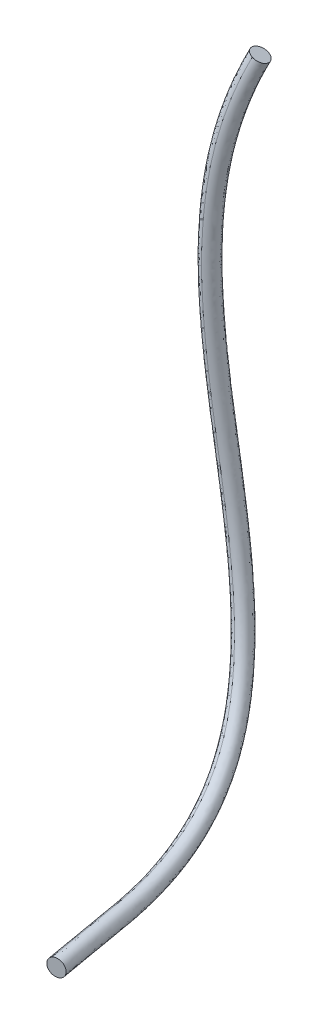
ISO-10303-21;
HEADER;
FILE_DESCRIPTION(('STEP AP214'),'2;1');
FILE_NAME('part.step','',(''),(''),'','','');
FILE_SCHEMA(('AUTOMOTIVE_DESIGN { 1 0 10303 214 1 1 1 1 }'));
ENDSEC;
DATA;
#1=APPLICATION_CONTEXT('core data for automotive mechanical design processes');
#2=APPLICATION_PROTOCOL_DEFINITION('international standard','automotive_design',2000,#1);
#3=PRODUCT_CONTEXT('',#1,'mechanical');
#4=PRODUCT('Part','Part','',(#3));
#5=PRODUCT_RELATED_PRODUCT_CATEGORY('part','',(#4));
#6=PRODUCT_DEFINITION_FORMATION('','',#4);
#7=PRODUCT_DEFINITION_CONTEXT('part definition',#1,'design');
#8=PRODUCT_DEFINITION('design','',#6,#7);
#9=PRODUCT_DEFINITION_SHAPE('','',#8);
#10=(LENGTH_UNIT() NAMED_UNIT(*) SI_UNIT(.MILLI.,.METRE.));
#11=(NAMED_UNIT(*) PLANE_ANGLE_UNIT() SI_UNIT($,.RADIAN.));
#12=(NAMED_UNIT(*) SI_UNIT($,.STERADIAN.) SOLID_ANGLE_UNIT());
#13=UNCERTAINTY_MEASURE_WITH_UNIT(LENGTH_MEASURE(1.E-05),#10,'distance_accuracy_value','');
#14=(GEOMETRIC_REPRESENTATION_CONTEXT(3) GLOBAL_UNCERTAINTY_ASSIGNED_CONTEXT((#13)) GLOBAL_UNIT_ASSIGNED_CONTEXT((#10,
#11,#12)) REPRESENTATION_CONTEXT('',''));
#15=CARTESIAN_POINT('',(0.,0.,0.));
#16=DIRECTION('',(0.,0.,1.));
#17=DIRECTION('',(1.,0.,0.));
#18=AXIS2_PLACEMENT_3D('',#15,#16,#17);
#19=CARTESIAN_POINT('',(-141.024062990475,58.5874318404684,-151.426198648371));
#20=CARTESIAN_POINT('',(-144.752577365455,60.0020186521244,-151.73784703149));
#21=CARTESIAN_POINT('',(-142.932795525807,58.3227268223134,-155.461873482319));
#22=CARTESIAN_POINT('',(-139.20428115163,56.9081400109578,-155.150225099257));
#23=CARTESIAN_POINT('',(-137.295548617087,57.1728450294168,-151.114550265385));
#24=CARTESIAN_POINT('',(-141.024062990475,58.5874318404684,-151.426198648371));
#25=CARTESIAN_POINT('',(-142.358130277843,55.2194093055224,-150.567133185133));
#26=CARTESIAN_POINT('',(-146.186631098976,56.3969638696767,-150.758459385626));
#27=CARTESIAN_POINT('',(-144.283496143097,55.0748582456913,-154.602822087222));
#28=CARTESIAN_POINT('',(-140.454995322775,53.8973036818015,-154.411495886778));
#29=CARTESIAN_POINT('',(-138.529629458345,54.0418547418712,-150.375806984722));
#30=CARTESIAN_POINT('',(-142.358130277843,55.2194093055224,-150.567133185133));
#31=CARTESIAN_POINT('',(-143.397041267958,51.6745219752108,-149.957116377115));
#32=CARTESIAN_POINT('',(-147.302417874414,52.5961797629623,-150.066721789742));
#33=CARTESIAN_POINT('',(-145.333926064203,51.6293021758677,-153.989315125928));
#34=CARTESIAN_POINT('',(-141.428549464311,50.7076443845857,-153.879709717409));
#35=CARTESIAN_POINT('',(-139.49166466317,50.7528641878531,-149.847510964535));
#36=CARTESIAN_POINT('',(-143.397041267958,51.6745219752108,-149.957116377115));
#37=CARTESIAN_POINT('',(-144.121486304218,48.0450348484982,-149.606930840791));
#38=CARTESIAN_POINT('',(-148.072377643987,48.722107864015,-149.675683046775));
#39=CARTESIAN_POINT('',(-146.065272589655,48.0812092972964,-153.634954226993));
#40=CARTESIAN_POINT('',(-142.11438125129,47.4041362804396,-153.566202021096));
#41=CARTESIAN_POINT('',(-140.170594966138,47.3679618332707,-149.538178634837));
#42=CARTESIAN_POINT('',(-144.121486304218,48.0450348484982,-149.606930840791));
#43=CARTESIAN_POINT('',(-145.125498324852,40.2403529208499,-149.278277068459));
#44=CARTESIAN_POINT('',(-149.131019077472,40.4697748045945,-149.311078413374));
#45=CARTESIAN_POINT('',(-147.077503491275,40.3889996827679,-153.299553810178));
#46=CARTESIAN_POINT('',(-143.071982738887,40.1595778007503,-153.266752465192));
#47=CARTESIAN_POINT('',(-141.119977573943,40.0109310372032,-149.245475723559));
#48=CARTESIAN_POINT('',(-145.125498324852,40.2403529208499,-149.278277068459));
#49=CARTESIAN_POINT('',(-145.173995161131,32.4103256520788,-149.551595417718));
#50=CARTESIAN_POINT('',(-149.17700697531,32.3180919019648,-149.602663845801));
#51=CARTESIAN_POINT('',(-147.125820333241,32.5514210523565,-153.572654428102));
#52=CARTESIAN_POINT('',(-143.122808520614,32.6436548005809,-153.521586000122));
#53=CARTESIAN_POINT('',(-141.170983348662,32.5025594021534,-149.500526989656));
#54=CARTESIAN_POINT('',(-145.173995161131,32.4103256520788,-149.551595417718));
#55=CARTESIAN_POINT('',(-144.994538299885,28.2843022971171,-149.774270139918));
#56=CARTESIAN_POINT('',(-148.990349915394,28.0506976692905,-149.834131686581));
#57=CARTESIAN_POINT('',(-146.945234575501,28.3874544447014,-153.797204374673));
#58=CARTESIAN_POINT('',(-142.949422961481,28.6210590705766,-153.737342828201));
#59=CARTESIAN_POINT('',(-140.998726686083,28.5179069248439,-149.714408593281));
#60=CARTESIAN_POINT('',(-144.994538299885,28.2843022971171,-149.774270139918));
#61=CARTESIAN_POINT('',(-144.450897668209,21.8015567339236,-150.136091518705));
#62=CARTESIAN_POINT('',(-148.429625060574,21.369179384841,-150.203078810353));
#63=CARTESIAN_POINT('',(-146.39875334703,21.7905686083378,-154.165389463157));
#64=CARTESIAN_POINT('',(-142.420025955148,22.2229459583996,-154.098402171416));
#65=CARTESIAN_POINT('',(-140.472170277544,22.2339340828216,-150.069104227085));
#66=CARTESIAN_POINT('',(-144.450897668209,21.8015567339236,-150.136091518705));
#67=CARTESIAN_POINT('',(-143.539179766019,15.3916349279216,-150.278634738437));
#68=CARTESIAN_POINT('',(-147.493441514954,14.785400628939,-150.328289054899));
#69=CARTESIAN_POINT('',(-145.474710347671,15.1344012077551,-154.30370729037));
#70=CARTESIAN_POINT('',(-141.520448599803,15.7406355059261,-154.254052973969));
#71=CARTESIAN_POINT('',(-139.584918018773,15.9978692266452,-150.228980421997));
#72=CARTESIAN_POINT('',(-143.539179766019,15.3916349279216,-150.278634738437));
#73=CARTESIAN_POINT('',(-143.156264316393,13.0383940566687,-150.281545294883));
#74=CARTESIAN_POINT('',(-147.100621661423,12.3701530381716,-150.320421430425));
#75=CARTESIAN_POINT('',(-145.085178839484,12.6684428253366,-154.30198780373));
#76=CARTESIAN_POINT('',(-141.14082149546,13.3366838417909,-154.263111667233));
#77=CARTESIAN_POINT('',(-139.211906973048,13.7066350748803,-150.242669159358));
#78=CARTESIAN_POINT('',(-143.156264316393,13.0383940566687,-150.281545294883));
#79=CARTESIAN_POINT('',(-142.397623074169,8.88434136373806,-150.159276436604));
#80=CARTESIAN_POINT('',(-146.322630181155,8.1079865119956,-150.168786740852));
#81=CARTESIAN_POINT('',(-144.309538184896,8.26501775138452,-154.163048563751));
#82=CARTESIAN_POINT('',(-140.384531078666,9.0413726044999,-154.153538260246));
#83=CARTESIAN_POINT('',(-138.472615968861,9.66069621514882,-150.14976613236));
#84=CARTESIAN_POINT('',(-142.397623074169,8.88434136373806,-150.159276436604));
#85=CARTESIAN_POINT('',(-141.504716664608,4.81665300265317,-149.692801547829));
#86=CARTESIAN_POINT('',(-145.407019255943,3.93672792409302,-149.650327447069));
#87=CARTESIAN_POINT('',(-143.377454206327,3.82526837487602,-153.636703525176));
#88=CARTESIAN_POINT('',(-139.47515161587,4.70519345209344,-153.679177625346));
#89=CARTESIAN_POINT('',(-137.60241407494,5.69657808083739,-149.73527564857));
#90=CARTESIAN_POINT('',(-141.504716664608,4.81665300265317,-149.692801547829));
#91=CARTESIAN_POINT('',(-141.090766013603,3.06671581554829,-149.405932924294));
#92=CARTESIAN_POINT('',(-144.982487551653,2.14256451908506,-149.335921411712));
#93=CARTESIAN_POINT('',(-142.940254304768,1.88489214862778,-153.311201785702));
#94=CARTESIAN_POINT('',(-139.048532766896,2.80904344588495,-153.38121329847));
#95=CARTESIAN_POINT('',(-137.199044477216,3.9908671116167,-149.475944436846));
#96=CARTESIAN_POINT('',(-141.090766013603,3.06671581554829,-149.405932924294));
#97=CARTESIAN_POINT('',(-140.316278263475,0.0262754071645934,-148.710826885396));
#98=CARTESIAN_POINT('',(-144.188195947192,-0.97250671800594,-148.582195079335));
#99=CARTESIAN_POINT('',(-142.107555167209,-1.55754989181469,-152.511910121074));
#100=CARTESIAN_POINT('',(-138.23563748483,-0.558767767739272,-152.640541926954));
#101=CARTESIAN_POINT('',(-136.444360581413,1.02505753190841,-148.839458691403));
#102=CARTESIAN_POINT('',(-140.316278263475,0.0262754071645934,-148.710826885396));
#103=CARTESIAN_POINT('',(-139.48611130491,-2.82475871704436,-147.596389393885));
#104=CARTESIAN_POINT('',(-143.337237433104,-3.88926579346545,-147.400662771694));
#105=CARTESIAN_POINT('',(-141.169248337742,-4.92431729128438,-151.182204865144));
#106=CARTESIAN_POINT('',(-137.318122209941,-3.85981021449803,-151.377931487424));
#107=CARTESIAN_POINT('',(-135.634985178362,-1.76025164107806,-147.792116015993));
#108=CARTESIAN_POINT('',(-139.48611130491,-2.82475871704436,-147.596389393885));
#109=CARTESIAN_POINT('',(-139.115736915424,-4.0202277636827,-147.01657375101));
#110=CARTESIAN_POINT('',(-142.957726070107,-5.11129885706828,-146.79113959093));
#111=CARTESIAN_POINT('',(-140.739281273302,-6.36666684670975,-150.480323751699));
#112=CARTESIAN_POINT('',(-136.897292119525,-5.27559575475991,-150.705757911508));
#113=CARTESIAN_POINT('',(-135.273747762383,-2.92915667076328,-147.242007910993));
#114=CARTESIAN_POINT('',(-139.115736915424,-4.0202277636827,-147.01657375101));
#115=CARTESIAN_POINT('',(-138.303696609553,-6.47864020328257,-145.529261832212));
#116=CARTESIAN_POINT('',(-142.12594662861,-7.6251317357244,-145.24653297144));
#117=CARTESIAN_POINT('',(-139.762811892408,-9.39166446298845,-148.64604208678));
#118=CARTESIAN_POINT('',(-135.940561874043,-8.24517292944807,-148.928770947748));
#119=CARTESIAN_POINT('',(-134.48144659213,-5.33214867133056,-145.811990692864));
#120=CARTESIAN_POINT('',(-138.303696609553,-6.47864020328257,-145.529261832212));
#121=CARTESIAN_POINT('',(-137.509828476229,-8.53717078004283,-143.545266614624));
#122=CARTESIAN_POINT('',(-141.309112083096,-9.74824617060122,-143.227008798627));
#123=CARTESIAN_POINT('',(-138.738090510783,-11.9969124504353,-146.153317420523));
#124=CARTESIAN_POINT('',(-134.938806904899,-10.7858370618239,-146.471575236134));
#125=CARTESIAN_POINT('',(-133.710544870985,-7.32609539000185,-143.863524430485));
#126=CARTESIAN_POINT('',(-137.509828476229,-8.53717078004283,-143.545266614624));
#127=CARTESIAN_POINT('',(-137.097355195376,-9.50292818193679,-142.327256894813));
#128=CARTESIAN_POINT('',(-140.881864190066,-10.7575309838084,-141.998504671917));
#129=CARTESIAN_POINT('',(-138.184446672341,-13.2211790412855,-144.617783525463));
#130=CARTESIAN_POINT('',(-134.399937678267,-11.966576239735,-144.946535748277));
#131=CARTESIAN_POINT('',(-133.312846202303,-8.2483253806012,-142.656009117568));
#132=CARTESIAN_POINT('',(-137.097355195376,-9.50292818193679,-142.327256894813));
#133=CARTESIAN_POINT('',(-136.165377920433,-11.4418538122007,-139.122249977693));
#134=CARTESIAN_POINT('',(-139.905013604418,-12.8204471208084,-138.765571064529));
#135=CARTESIAN_POINT('',(-136.919991893717,-15.6340763364926,-140.65329064254));
#136=CARTESIAN_POINT('',(-133.180356210722,-14.2554830281263,-141.009969555639));
#137=CARTESIAN_POINT('',(-132.425742238045,-10.0632605041819,-139.478928890704));
#138=CARTESIAN_POINT('',(-136.165377920433,-11.4418538122007,-139.122249977693));
#139=CARTESIAN_POINT('',(-135.37529825334,-12.5473775114005,-135.429144487566));
#140=CARTESIAN_POINT('',(-139.058157082525,-14.060000325903,-135.02832965646));
#141=CARTESIAN_POINT('',(-135.849825779207,-16.9346279355247,-136.302224214791));
#142=CARTESIAN_POINT('',(-132.16696695052,-15.4220051214249,-136.703039045795));
#143=CARTESIAN_POINT('',(-131.692439425728,-11.0347546975443,-135.8299593185));
#144=CARTESIAN_POINT('',(-135.37529825334,-12.5473775114005,-135.429144487566));
#145=CARTESIAN_POINT('',(-134.959407823452,-12.9501640468151,-133.171831831221));
#146=CARTESIAN_POINT('',(-138.609370754849,-14.5299189860105,-132.735473647884));
#147=CARTESIAN_POINT('',(-135.304174850723,-17.3873624599936,-133.736196028956));
#148=CARTESIAN_POINT('',(-131.654211930084,-15.8076075322653,-134.172554209475));
#149=CARTESIAN_POINT('',(-131.309444893615,-11.3704091082946,-133.608190014372));
#150=CARTESIAN_POINT('',(-134.959407823452,-12.9501640468151,-133.171831831221));
#151=CARTESIAN_POINT('',(-134.584510726923,-13.1641947919875,-130.882417712924));
#152=CARTESIAN_POINT('',(-138.204978492784,-14.7993490517736,-130.410677810424));
#153=CARTESIAN_POINT('',(-134.822190639272,-17.6255043126306,-131.190321780092));
#154=CARTESIAN_POINT('',(-131.201722874314,-15.9903500534696,-131.662061682472));
#155=CARTESIAN_POINT('',(-130.964042962609,-11.5290405329,-131.354157615223));
#156=CARTESIAN_POINT('',(-134.584510726923,-13.1641947919875,-130.882417712924));
#157=CARTESIAN_POINT('',(-133.979497838754,-13.2785692118519,-126.793318265199));
#158=CARTESIAN_POINT('',(-137.552911557316,-14.9958248843589,-126.260254797737));
#159=CARTESIAN_POINT('',(-134.05864860252,-17.7530177439156,-126.719321799913));
#160=CARTESIAN_POINT('',(-130.485234884598,-16.0357620714816,-127.252385267309));
#161=CARTESIAN_POINT('',(-130.406084121718,-11.5613135400785,-127.326381732434));
#162=CARTESIAN_POINT('',(-133.979497838754,-13.2785692118519,-126.793318265199));
#163=CARTESIAN_POINT('',(-133.716139468966,-13.3283556897104,-125.013358556058));
#164=CARTESIAN_POINT('',(-137.269070851645,-15.081349599591,-124.453601319895));
#165=CARTESIAN_POINT('',(-133.726283474445,-17.8085235522147,-124.773123150057));
#166=CARTESIAN_POINT('',(-130.173352092291,-16.0555296421669,-125.332880386176));
#167=CARTESIAN_POINT('',(-130.163208087804,-11.5753617805787,-125.573115791982));
#168=CARTESIAN_POINT('',(-133.716139468966,-13.3283556897104,-125.013358556058));
#169=CARTESIAN_POINT('',(-133.452781099177,-13.3781421675687,-123.233398846916));
#170=CARTESIAN_POINT('',(-136.985230145975,-15.1668743148229,-122.646947842052));
#171=CARTESIAN_POINT('',(-133.39391834637,-17.8640293605139,-122.826924500201));
#172=CARTESIAN_POINT('',(-129.861469299984,-16.0752972128522,-123.413375505044));
#173=CARTESIAN_POINT('',(-129.920332053889,-11.5894100210788,-123.81984985153));
#174=CARTESIAN_POINT('',(-133.452781099177,-13.3781421675687,-123.233398846916));
#175=CARTESIAN_POINT('',(-133.18942272939,-13.4279286454272,-121.453439137774));
#176=CARTESIAN_POINT('',(-136.701389440305,-15.2523990300549,-120.840294364209));
#177=CARTESIAN_POINT('',(-133.061553218295,-17.919535168813,-120.880725850344));
#178=CARTESIAN_POINT('',(-129.549586507676,-16.0950647835375,-121.493870623912));
#179=CARTESIAN_POINT('',(-129.677456019975,-11.603458261579,-122.066583911078));
#180=CARTESIAN_POINT('',(-133.18942272939,-13.4279286454272,-121.453439137774));
#181=CARTESIAN_POINT('',(-132.926064359602,-13.4777151232856,-119.673479428633));
#182=CARTESIAN_POINT('',(-136.417548734635,-15.3379237452869,-119.033640886367));
#183=CARTESIAN_POINT('',(-132.72918809022,-17.9750409771122,-118.934527200488));
#184=CARTESIAN_POINT('',(-129.237703715369,-16.1148323542228,-119.574365742779));
#185=CARTESIAN_POINT('',(-129.434579986061,-11.6175065020791,-120.313317970626));
#186=CARTESIAN_POINT('',(-132.926064359602,-13.4777151232856,-119.673479428633));
#187=(BOUNDED_SURFACE() B_SPLINE_SURFACE(5,5,((#19,#20,#21,#22,#23,#24),(#25,#26,#27,#28,#29,
#30),(#31,#32,#33,#34,#35,#36),(#37,#38,#39,#40,#41,#42),(#43,#44,#45,#46,#47,#48),(#49,#50,#51,
#52,#53,#54),(#55,#56,#57,#58,#59,#60),(#61,#62,#63,#64,#65,#66),(#67,#68,#69,#70,#71,#72),(#73,
#74,#75,#76,#77,#78),(#79,#80,#81,#82,#83,#84),(#85,#86,#87,#88,#89,#90),(#91,#92,#93,#94,#95,
#96),(#97,#98,#99,#100,#101,#102),(#103,#104,#105,#106,#107,#108),(#109,#110,#111,#112,#113,
#114),(#115,#116,#117,#118,#119,#120),(#121,#122,#123,#124,#125,#126),(#127,#128,#129,#130,#131,
#132),(#133,#134,#135,#136,#137,#138),(#139,#140,#141,#142,#143,#144),(#145,#146,#147,#148,#149,
#150),(#151,#152,#153,#154,#155,#156),(#157,#158,#159,#160,#161,#162),(#163,#164,#165,#166,#167,
#168),(#169,#170,#171,#172,#173,#174),(#175,#176,#177,#178,#179,#180),(#181,#182,#183,#184,#185,
#186)),.UNSPECIFIED.,.F.,.T.,.F.) B_SPLINE_SURFACE_WITH_KNOTS((6,3,3,3,3,3,3,4,6),(6,6),(0.,
0.186963835931081,0.397489690820225,0.521206251091236,0.61739832046589,0.692412724107272,
0.781643180733497,0.904950626542738,1.),(0.,1.),
.UNSPECIFIED.) GEOMETRIC_REPRESENTATION_ITEM() RATIONAL_B_SPLINE_SURFACE(((1.,0.2,0.2,0.2,0.2,
1.),(1.,0.2,0.2,0.2,0.2,1.),(1.,0.2,0.2,0.2,0.2,1.),(1.,0.2,0.2,0.2,0.2,1.),(1.,0.2,0.2,0.2,0.2,
1.),(1.,0.2,0.2,0.2,0.2,1.),(1.,0.2,0.2,0.2,0.2,1.),(1.,0.2,0.2,0.2,0.2,1.),(1.,0.2,0.2,0.2,0.2,
1.),(1.,0.2,0.2,0.2,0.2,1.),(1.,0.2,0.2,0.2,0.2,1.),(1.,0.2,0.2,0.2,0.2,1.),(1.,0.2,0.2,0.2,0.2,
1.),(1.,0.2,0.2,0.2,0.2,1.),(1.,0.2,0.2,0.2,0.2,1.),(1.,0.2,0.2,0.2,0.2,1.),(1.,0.2,0.2,0.2,0.2,
1.),(1.,0.2,0.2,0.2,0.2,1.),(1.,0.2,0.2,0.2,0.2,1.),(1.,0.2,0.2,0.2,0.2,1.),(1.,0.2,0.2,0.2,0.2,
1.),(1.,0.2,0.2,0.2,0.2,1.),(1.,0.2,0.2,0.2,0.2,1.),(1.,0.2,0.2,0.2,0.2,1.),(1.,0.2,0.2,0.2,0.2,
1.),(1.,0.2,0.2,0.2,0.2,1.),(1.,0.2,0.2,0.2,0.2,1.),(1.,0.2,0.2,0.2,0.2,1.))) REPRESENTATION_ITEM('') SURFACE());
#188=CARTESIAN_POINT('',(-136.132725295723,70.9362359382635,-154.575949281789));
#189=CARTESIAN_POINT('',(-137.110992834833,68.4664751187659,-153.945999155119));
#190=CARTESIAN_POINT('',(-138.089260373942,65.9967142992683,-153.316049028449));
#191=CARTESIAN_POINT('',(-139.067527913051,63.5269534797706,-152.686098901779));
#192=CARTESIAN_POINT('',(-140.04579545216,61.057192660273,-152.056148775108));
#193=CARTESIAN_POINT('',(-142.358130278669,55.2194093057612,-150.567133185171));
#194=CARTESIAN_POINT('',(-143.397041265261,51.6745219699475,-149.957116375735));
#195=CARTESIAN_POINT('',(-144.121486305216,48.0450348486379,-149.606930840782));
#196=CARTESIAN_POINT('',(-145.125498325565,40.240352920804,-149.278277068475));
#197=CARTESIAN_POINT('',(-145.173995162182,32.4103256520678,-149.551595417697));
#198=CARTESIAN_POINT('',(-144.994538299869,28.2843022989043,-149.774270139739));
#199=CARTESIAN_POINT('',(-144.450897669587,21.8015567327019,-150.136091518818));
#200=CARTESIAN_POINT('',(-143.539179766536,15.3916349284467,-150.278634738382));
#201=CARTESIAN_POINT('',(-143.156264317144,13.0383940572314,-150.281545294924));
#202=CARTESIAN_POINT('',(-142.397623075112,8.88434136297565,-150.159276436573));
#203=CARTESIAN_POINT('',(-141.504716665329,4.81665300285208,-149.692801547833));
#204=CARTESIAN_POINT('',(-141.090766014295,3.06671581566303,-149.405932924381));
#205=CARTESIAN_POINT('',(-140.316278264336,0.0262754066597112,-148.71082688528));
#206=CARTESIAN_POINT('',(-139.486111305727,-2.82475871707438,-147.596389393912));
#207=CARTESIAN_POINT('',(-139.115736916103,-4.0202277632427,-147.016573751104));
#208=CARTESIAN_POINT('',(-138.303696610552,-6.47864020434302,-145.529261831986));
#209=CARTESIAN_POINT('',(-137.509828476769,-8.5371707793593,-143.545266614758));
#210=CARTESIAN_POINT('',(-137.097355196089,-9.50292818222133,-142.327256894678));
#211=CARTESIAN_POINT('',(-136.165377921423,-11.4418538124565,-139.122249977714));
#212=CARTESIAN_POINT('',(-135.375298253838,-12.5473775117833,-135.429144487344));
#213=CARTESIAN_POINT('',(-134.959407814271,-12.950164037205,-133.171831841026));
#214=CARTESIAN_POINT('',(-134.584510727664,-13.1641947920378,-130.882417712869));
#215=CARTESIAN_POINT('',(-134.217782259509,-13.2335228291501,-128.403810717861));
#216=CARTESIAN_POINT('',(-134.192708309722,-13.238262923995,-128.234343461482));
#217=CARTESIAN_POINT('',(-134.167634359935,-13.2430030188399,-128.064876205102));
#218=CARTESIAN_POINT('',(-134.142560410148,-13.2477431136848,-127.895408948723));
#219=CARTESIAN_POINT('',(-133.737616121088,-13.3242956454302,-125.158512758193));
#220=CARTESIAN_POINT('',(-133.357745781815,-13.3961080823306,-122.591083824043));
#221=CARTESIAN_POINT('',(-132.977875442542,-13.467920519231,-120.023654889893));
#222=CARTESIAN_POINT('',(-132.598005103269,-13.5397329561315,-117.456225955743));
#223=CARTESIAN_POINT('',(-132.218134763997,-13.6115453930319,-114.888797021593));
#224=B_SPLINE_CURVE_WITH_KNOTS('',5,(#188,#189,#190,#191,#192,#193,#194,#195,#196,#197,#198,
#199,#200,#201,#202,#203,#204,#205,#206,#207,#208,#209,#210,#211,#212,#213,#214,#215,#216,#217,
#218,#219,#220,#221,#222,#223),.UNSPECIFIED.,.F.,.F.,(6,4,3,3,3,3,3,3,4,4,6),(0.,
0.115384615384615,0.272735068813692,0.449915530267007,0.554036505098231,0.63499261972332,
0.698125419539399,0.77322257798129,0.876999238385377,0.884615384615385,1.),.UNSPECIFIED.);
#225=CARTESIAN_POINT('',(-141.02406299127,58.5874318407753,-151.426198648438));
#226=VERTEX_POINT('',#225);
#227=CARTESIAN_POINT('',(-132.926064360605,-13.4777151242576,-119.673479428453));
#228=VERTEX_POINT('',#227);
#229=EDGE_CURVE('E41',#226,#228,#224,.T.);
#230=CARTESIAN_POINT('',(-141.035181828133,58.344432234737,-152.396161309025));
#231=DIRECTION('',(-0.361956705369102,-0.903263638722896,0.230439020999958));
#232=DIRECTION('',(0.932012785910499,-0.355540802306565,0.0703057948860118));
#233=AXIS2_PLACEMENT_3D('',#230,#231,#232);
#234=CIRCLE('',#233,1.);
#235=CARTESIAN_POINT('',(-141.046300664994,58.1014326287077,-153.366123969616));
#236=VERTEX_POINT('',#235);
#237=EDGE_CURVE('E11',#226,#236,#234,.T.);
#238=CARTESIAN_POINT('',(-136.216119743413,70.012696588423,-156.405558943225));
#239=CARTESIAN_POINT('',(-137.182155927729,67.63044379648,-155.797671948504));
#240=CARTESIAN_POINT('',(-138.148192112045,65.2481910045369,-155.189784953782));
#241=CARTESIAN_POINT('',(-139.114228296362,62.8659382125938,-154.581897959059));
#242=CARTESIAN_POINT('',(-140.080264480678,60.4836854206508,-153.974010964338));
#243=CARTESIAN_POINT('',(-142.363688005797,54.8527451347517,-152.537146086089));
#244=CARTESIAN_POINT('',(-143.389139515638,51.4214976264644,-151.945814399051));
#245=CARTESIAN_POINT('',(-144.105656612805,47.893853818741,-151.603754482418));
#246=CARTESIAN_POINT('',(-145.100120720362,40.2573208312936,-151.280715103075));
#247=CARTESIAN_POINT('',(-145.149154794496,32.5039317893026,-151.549357815915));
#248=CARTESIAN_POINT('',(-144.970933534389,28.3942795278482,-151.770771870644));
#249=CARTESIAN_POINT('',(-144.43014366022,21.9041570082701,-152.133993668022));
#250=CARTESIAN_POINT('',(-143.518379620231,15.4145766424314,-152.278757435289));
#251=CARTESIAN_POINT('',(-143.134632242333,13.0204786952204,-152.282047515203));
#252=CARTESIAN_POINT('',(-142.372328853399,8.76876827062431,-152.158784924318));
#253=CARTESIAN_POINT('',(-141.465509788296,4.54094195806378,-151.675371061525));
#254=CARTESIAN_POINT('',(-141.042579775133,2.70684180640838,-151.376070233185));
#255=CARTESIAN_POINT('',(-140.243937295199,-0.515941711449576,-150.643526454661));
#256=CARTESIAN_POINT('',(-139.364898289756,-3.60841123506978,-149.438228785098));
#257=CARTESIAN_POINT('',(-138.967011806306,-4.92067953215331,-148.804807291316));
#258=CARTESIAN_POINT('',(-138.077691746841,-7.64852945011612,-147.158334174662));
#259=CARTESIAN_POINT('',(-137.174138592318,-9.96427276796975,-144.928856471495));
#260=CARTESIAN_POINT('',(-136.694773685738,-11.0484029113313,-143.554708265796));
#261=CARTESIAN_POINT('',(-135.607775986749,-13.1933167473993,-139.976940038376));
#262=CARTESIAN_POINT('',(-134.691847309368,-14.3628470201045,-135.965888058858));
#263=CARTESIAN_POINT('',(-134.219300604827,-14.7738245191535,-133.563103477642));
#264=CARTESIAN_POINT('',(-133.798233742273,-14.9860609876094,-131.15430472207));
#265=CARTESIAN_POINT('',(-133.390589515562,-15.0469296896809,-128.569246070186));
#266=CARTESIAN_POINT('',(-133.36271807454,-15.0510914030789,-128.392500503746));
#267=CARTESIAN_POINT('',(-133.334846633517,-15.0552531164769,-128.215754937306));
#268=CARTESIAN_POINT('',(-133.306975192495,-15.0594148298749,-128.039009370866));
#269=CARTESIAN_POINT('',(-132.85685141998,-15.1266265012522,-125.184568472858));
#270=CARTESIAN_POINT('',(-132.434599088488,-15.1896764592316,-122.506873141291));
#271=CARTESIAN_POINT('',(-132.012346756995,-15.252726417211,-119.829177809723));
#272=CARTESIAN_POINT('',(-131.590094425503,-15.3157763751904,-117.151482478156));
#273=CARTESIAN_POINT('',(-131.167842094011,-15.3788263331697,-114.473787146588));
#274=B_SPLINE_CURVE_WITH_KNOTS('',5,(#238,#239,#240,#241,#242,#243,#244,#245,#246,#247,#248,
#249,#250,#251,#252,#253,#254,#255,#256,#257,#258,#259,#260,#261,#262,#263,#264,#265,#266,#267,
#268,#269,#270,#271,#272,#273),.UNSPECIFIED.,.F.,.F.,(6,4,3,3,3,3,3,3,4,4,6),(0.,
0.115384615384615,0.272735068813692,0.449915530267007,0.554036505098231,0.63499261972332,
0.698125419539399,0.77322257798129,0.876999238385377,0.884615384615385,1.),.UNSPECIFIED.);
#275=CARTESIAN_POINT('',(-132.016913082952,-15.2520445815603,-119.858134972688));
#276=VERTEX_POINT('',#275);
#277=EDGE_CURVE('E33',#236,#276,#274,.T.);
#278=CARTESIAN_POINT('',(-132.926064360781,-13.4777151239138,-119.673479428417));
#279=CARTESIAN_POINT('',(-132.950781735837,-13.4907715105554,-119.670035172368));
#280=CARTESIAN_POINT('',(-132.974946314458,-13.5048747192352,-119.666702369836));
#281=CARTESIAN_POINT('',(-133.022022345436,-13.5350830873396,-119.660279876071));
#282=CARTESIAN_POINT('',(-133.044933857751,-13.5511881508539,-119.657190173203));
#283=CARTESIAN_POINT('',(-133.111500059529,-13.6023161428818,-119.648324984891));
#284=CARTESIAN_POINT('',(-133.153066276942,-13.6401941597409,-119.642942293764));
#285=CARTESIAN_POINT('',(-133.229345660028,-13.7224434438099,-119.633391884419));
#286=CARTESIAN_POINT('',(-133.264055635106,-13.7668177174475,-119.629224731431));
#287=CARTESIAN_POINT('',(-133.325638023,-13.8607967971202,-119.622223489941));
#288=CARTESIAN_POINT('',(-133.352511973251,-13.9104005745176,-119.619389139875));
#289=CARTESIAN_POINT('',(-133.397662642165,-14.0134378988267,-119.61513366204));
#290=CARTESIAN_POINT('',(-133.415938515677,-14.0668718216297,-119.613712673183));
#291=CARTESIAN_POINT('',(-133.44337256904,-14.1760497689039,-119.612324436981));
#292=CARTESIAN_POINT('',(-133.452530731272,-14.2317937978389,-119.612357192445));
#293=CARTESIAN_POINT('',(-133.461468885393,-14.344010933943,-119.613875627662));
#294=CARTESIAN_POINT('',(-133.461248571039,-14.4004840648599,-119.615361354859));
#295=CARTESIAN_POINT('',(-133.451435746778,-14.5125508999425,-119.61974346201));
#296=CARTESIAN_POINT('',(-133.441843836414,-14.5681446601341,-119.622639751719));
#297=CARTESIAN_POINT('',(-133.413560631422,-14.6768795866893,-119.629760814386));
#298=CARTESIAN_POINT('',(-133.39486914017,-14.7300207000291,-119.633985616049));
#299=CARTESIAN_POINT('',(-133.348916735143,-14.8323417407633,-119.643643868142));
#300=CARTESIAN_POINT('',(-133.321655624669,-14.8815215772022,-119.649077346313));
#301=CARTESIAN_POINT('',(-133.259338351092,-14.9745221399266,-119.660998585747));
#302=CARTESIAN_POINT('',(-133.224282265458,-15.0183429194651,-119.667486336532));
#303=CARTESIAN_POINT('',(-133.147369956194,-15.0993818495156,-119.681331998276));
#304=CARTESIAN_POINT('',(-133.105513752127,-15.1366000190219,-119.68868990673));
#305=CARTESIAN_POINT('',(-133.016188820043,-15.2033783137046,-119.704067128403));
#306=CARTESIAN_POINT('',(-132.968719946756,-15.2329382406027,-119.71208645874));
#307=CARTESIAN_POINT('',(-132.869518095522,-15.2835580236545,-119.728558663905));
#308=CARTESIAN_POINT('',(-132.817785333856,-15.3046183106199,-119.737011516735));
#309=CARTESIAN_POINT('',(-132.711529304816,-15.3376449913405,-119.754110145038));
#310=CARTESIAN_POINT('',(-132.657005917289,-15.3496109931778,-119.762755928809));
#311=CARTESIAN_POINT('',(-132.546685085289,-15.3641034121074,-119.779999624174));
#312=CARTESIAN_POINT('',(-132.490887689863,-15.3666301919836,-119.788597537595));
#313=CARTESIAN_POINT('',(-132.407463777516,-15.3632970905823,-119.801269630558));
#314=CARTESIAN_POINT('',(-132.379672302991,-15.3609927061198,-119.805460455429));
#315=CARTESIAN_POINT('',(-132.324396872437,-15.3540307036701,-119.813734570941));
#316=CARTESIAN_POINT('',(-132.296912685101,-15.3493749973718,-119.817817946109));
#317=CARTESIAN_POINT('',(-132.215228357265,-15.3319176657773,-119.829860847412));
#318=CARTESIAN_POINT('',(-132.161681739923,-15.3156211541455,-119.837630571625));
#319=CARTESIAN_POINT('',(-132.094068036917,-15.2886025418744,-119.847275850978));
#320=CARTESIAN_POINT('',(-132.078366157951,-15.2818480733642,-119.849503426258));
#321=CARTESIAN_POINT('',(-132.047350272842,-15.2675416528106,-119.853878755607));
#322=CARTESIAN_POINT('',(-132.032035673663,-15.259991024753,-119.856026634409));
#323=CARTESIAN_POINT('',(-132.016913082996,-15.2520445814743,-119.858134972682));
#324=B_SPLINE_CURVE_WITH_KNOTS('',3,(#278,#279,#280,#281,#282,#283,#284,#285,#286,#287,#288,
#289,#290,#291,#292,#293,#294,#295,#296,#297,#298,#299,#300,#301,#302,#303,#304,#305,#306,#307,
#308,#309,#310,#311,#312,#313,#314,#315,#316,#317,#318,#319,#320,#321,#322,#323),.UNSPECIFIED.,
.F.,.F.,(4,2,2,2,2,2,2,2,2,2,2,2,2,2,2,2,2,2,2,2,2,2,4),(0.,0.0844438214260697,
0.168883598643907,0.337493480127999,0.506181641360792,0.674836683505569,0.843508300211857,
1.01218024285587,1.18085769330655,1.34952435342943,1.51819465824857,1.68686883483204,
1.85554133515783,2.02421335023964,2.19288973194267,2.36155756306038,2.53023266250134,
2.69890127907237,2.78341220431133,2.86785453020231,3.03639496264098,3.08809413255151,
3.13970864538179),.UNSPECIFIED.);
#325=EDGE_CURVE('E49',#228,#276,#324,.T.);
#326=ORIENTED_EDGE('',*,*,#229,.F.);
#327=ORIENTED_EDGE('',*,*,#237,.T.);
#328=ORIENTED_EDGE('',*,*,#277,.T.);
#329=ORIENTED_EDGE('',*,*,#325,.F.);
#330=EDGE_LOOP('',(#326,#327,#328,#329));
#331=FACE_BOUND('',#330,.T.);
#332=ADVANCED_FACE('F17',(#331),#187,.F.);
#333=CARTESIAN_POINT('',(-141.024062990474,58.5874318404684,-151.426198648371));
#334=CARTESIAN_POINT('',(-144.752577365455,60.0020186521244,-151.73784703149));
#335=CARTESIAN_POINT('',(-142.932795525807,58.3227268223134,-155.461873482319));
#336=CARTESIAN_POINT('',(-139.20428115163,56.9081400109578,-155.150225099257));
#337=CARTESIAN_POINT('',(-137.295548617087,57.1728450294168,-151.114550265385));
#338=CARTESIAN_POINT('',(-141.024062990474,58.5874318404684,-151.426198648371));
#339=CARTESIAN_POINT('',(-142.358130277843,55.2194093055224,-150.567133185133));
#340=CARTESIAN_POINT('',(-146.186631098976,56.3969638696767,-150.758459385626));
#341=CARTESIAN_POINT('',(-144.283496143097,55.0748582456913,-154.602822087222));
#342=CARTESIAN_POINT('',(-140.454995322775,53.8973036818015,-154.411495886778));
#343=CARTESIAN_POINT('',(-138.529629458345,54.0418547418712,-150.375806984722));
#344=CARTESIAN_POINT('',(-142.358130277843,55.2194093055224,-150.567133185133));
#345=CARTESIAN_POINT('',(-143.397041267958,51.6745219752108,-149.957116377115));
#346=CARTESIAN_POINT('',(-147.302417874414,52.5961797629623,-150.066721789742));
#347=CARTESIAN_POINT('',(-145.333926064203,51.6293021758677,-153.989315125928));
#348=CARTESIAN_POINT('',(-141.428549464311,50.7076443845857,-153.879709717409));
#349=CARTESIAN_POINT('',(-139.49166466317,50.7528641878531,-149.847510964535));
#350=CARTESIAN_POINT('',(-143.397041267958,51.6745219752108,-149.957116377115));
#351=CARTESIAN_POINT('',(-144.121486304218,48.0450348484982,-149.606930840791));
#352=CARTESIAN_POINT('',(-148.072377643987,48.722107864015,-149.675683046775));
#353=CARTESIAN_POINT('',(-146.065272589655,48.0812092972964,-153.634954226993));
#354=CARTESIAN_POINT('',(-142.11438125129,47.4041362804396,-153.566202021096));
#355=CARTESIAN_POINT('',(-140.170594966138,47.3679618332707,-149.538178634837));
#356=CARTESIAN_POINT('',(-144.121486304218,48.0450348484982,-149.606930840791));
#357=CARTESIAN_POINT('',(-145.125498324852,40.2403529208499,-149.278277068459));
#358=CARTESIAN_POINT('',(-149.131019077472,40.4697748045945,-149.311078413374));
#359=CARTESIAN_POINT('',(-147.077503491275,40.3889996827679,-153.299553810178));
#360=CARTESIAN_POINT('',(-143.071982738887,40.1595778007503,-153.266752465192));
#361=CARTESIAN_POINT('',(-141.119977573943,40.0109310372032,-149.245475723559));
#362=CARTESIAN_POINT('',(-145.125498324852,40.2403529208499,-149.278277068459));
#363=CARTESIAN_POINT('',(-145.173995161131,32.4103256520788,-149.551595417718));
#364=CARTESIAN_POINT('',(-149.17700697531,32.3180919019648,-149.602663845801));
#365=CARTESIAN_POINT('',(-147.125820333241,32.5514210523565,-153.572654428102));
#366=CARTESIAN_POINT('',(-143.122808520614,32.6436548005809,-153.521586000122));
#367=CARTESIAN_POINT('',(-141.170983348662,32.5025594021534,-149.500526989656));
#368=CARTESIAN_POINT('',(-145.173995161131,32.4103256520788,-149.551595417718));
#369=CARTESIAN_POINT('',(-144.994538299885,28.2843022971171,-149.774270139918));
#370=CARTESIAN_POINT('',(-148.990349915394,28.0506976692905,-149.834131686581));
#371=CARTESIAN_POINT('',(-146.945234575501,28.3874544447014,-153.797204374673));
#372=CARTESIAN_POINT('',(-142.949422961481,28.6210590705766,-153.737342828201));
#373=CARTESIAN_POINT('',(-140.998726686083,28.5179069248439,-149.714408593281));
#374=CARTESIAN_POINT('',(-144.994538299885,28.2843022971171,-149.774270139918));
#375=CARTESIAN_POINT('',(-144.450897668209,21.8015567339236,-150.136091518705));
#376=CARTESIAN_POINT('',(-148.429625060574,21.369179384841,-150.203078810353));
#377=CARTESIAN_POINT('',(-146.39875334703,21.7905686083378,-154.165389463157));
#378=CARTESIAN_POINT('',(-142.420025955148,22.2229459583996,-154.098402171416));
#379=CARTESIAN_POINT('',(-140.472170277544,22.2339340828216,-150.069104227085));
#380=CARTESIAN_POINT('',(-144.450897668209,21.8015567339236,-150.136091518705));
#381=CARTESIAN_POINT('',(-143.539179766019,15.3916349279216,-150.278634738437));
#382=CARTESIAN_POINT('',(-147.493441514954,14.785400628939,-150.328289054899));
#383=CARTESIAN_POINT('',(-145.474710347671,15.1344012077551,-154.30370729037));
#384=CARTESIAN_POINT('',(-141.520448599803,15.7406355059261,-154.254052973969));
#385=CARTESIAN_POINT('',(-139.584918018773,15.9978692266452,-150.228980421997));
#386=CARTESIAN_POINT('',(-143.539179766019,15.3916349279216,-150.278634738437));
#387=CARTESIAN_POINT('',(-143.156264316393,13.0383940566687,-150.281545294883));
#388=CARTESIAN_POINT('',(-147.100621661423,12.3701530381716,-150.320421430425));
#389=CARTESIAN_POINT('',(-145.085178839484,12.6684428253366,-154.30198780373));
#390=CARTESIAN_POINT('',(-141.14082149546,13.3366838417909,-154.263111667233));
#391=CARTESIAN_POINT('',(-139.211906973048,13.7066350748803,-150.242669159358));
#392=CARTESIAN_POINT('',(-143.156264316393,13.0383940566687,-150.281545294883));
#393=CARTESIAN_POINT('',(-142.397623074169,8.88434136373806,-150.159276436604));
#394=CARTESIAN_POINT('',(-146.322630181155,8.1079865119956,-150.168786740852));
#395=CARTESIAN_POINT('',(-144.309538184896,8.26501775138452,-154.163048563751));
#396=CARTESIAN_POINT('',(-140.384531078666,9.0413726044999,-154.153538260246));
#397=CARTESIAN_POINT('',(-138.472615968861,9.66069621514882,-150.14976613236));
#398=CARTESIAN_POINT('',(-142.397623074169,8.88434136373806,-150.159276436604));
#399=CARTESIAN_POINT('',(-141.504716664608,4.81665300265318,-149.692801547829));
#400=CARTESIAN_POINT('',(-145.407019255943,3.93672792409302,-149.650327447069));
#401=CARTESIAN_POINT('',(-143.377454206327,3.82526837487602,-153.636703525176));
#402=CARTESIAN_POINT('',(-139.47515161587,4.70519345209344,-153.679177625346));
#403=CARTESIAN_POINT('',(-137.60241407494,5.69657808083739,-149.73527564857));
#404=CARTESIAN_POINT('',(-141.504716664608,4.81665300265318,-149.692801547829));
#405=CARTESIAN_POINT('',(-141.090766013603,3.0667158155483,-149.405932924294));
#406=CARTESIAN_POINT('',(-144.982487551653,2.14256451908506,-149.335921411712));
#407=CARTESIAN_POINT('',(-142.940254304768,1.88489214862778,-153.311201785702));
#408=CARTESIAN_POINT('',(-139.048532766896,2.80904344588495,-153.38121329847));
#409=CARTESIAN_POINT('',(-137.199044477216,3.9908671116167,-149.475944436846));
#410=CARTESIAN_POINT('',(-141.090766013603,3.0667158155483,-149.405932924294));
#411=CARTESIAN_POINT('',(-140.316278263475,0.0262754071645999,-148.710826885396));
#412=CARTESIAN_POINT('',(-144.188195947192,-0.97250671800594,-148.582195079335));
#413=CARTESIAN_POINT('',(-142.107555167209,-1.55754989181469,-152.511910121074));
#414=CARTESIAN_POINT('',(-138.23563748483,-0.558767767739272,-152.640541926954));
#415=CARTESIAN_POINT('',(-136.444360581413,1.02505753190841,-148.839458691403));
#416=CARTESIAN_POINT('',(-140.316278263475,0.0262754071645999,-148.710826885396));
#417=CARTESIAN_POINT('',(-139.48611130491,-2.82475871704435,-147.596389393885));
#418=CARTESIAN_POINT('',(-143.337237433104,-3.88926579346545,-147.400662771694));
#419=CARTESIAN_POINT('',(-141.169248337742,-4.92431729128438,-151.182204865144));
#420=CARTESIAN_POINT('',(-137.318122209941,-3.85981021449803,-151.377931487424));
#421=CARTESIAN_POINT('',(-135.634985178362,-1.76025164107806,-147.792116015993));
#422=CARTESIAN_POINT('',(-139.48611130491,-2.82475871704435,-147.596389393885));
#423=CARTESIAN_POINT('',(-139.115736915424,-4.0202277636827,-147.01657375101));
#424=CARTESIAN_POINT('',(-142.957726070107,-5.11129885706828,-146.79113959093));
#425=CARTESIAN_POINT('',(-140.739281273302,-6.36666684670975,-150.480323751699));
#426=CARTESIAN_POINT('',(-136.897292119525,-5.27559575475991,-150.705757911508));
#427=CARTESIAN_POINT('',(-135.273747762383,-2.92915667076328,-147.242007910993));
#428=CARTESIAN_POINT('',(-139.115736915424,-4.0202277636827,-147.01657375101));
#429=CARTESIAN_POINT('',(-138.303696609553,-6.47864020328256,-145.529261832212));
#430=CARTESIAN_POINT('',(-142.12594662861,-7.6251317357244,-145.24653297144));
#431=CARTESIAN_POINT('',(-139.762811892408,-9.39166446298845,-148.64604208678));
#432=CARTESIAN_POINT('',(-135.940561874043,-8.24517292944807,-148.928770947748));
#433=CARTESIAN_POINT('',(-134.48144659213,-5.33214867133056,-145.811990692864));
#434=CARTESIAN_POINT('',(-138.303696609553,-6.47864020328256,-145.529261832212));
#435=CARTESIAN_POINT('',(-137.509828476229,-8.53717078004282,-143.545266614624));
#436=CARTESIAN_POINT('',(-141.309112083096,-9.74824617060122,-143.227008798627));
#437=CARTESIAN_POINT('',(-138.738090510783,-11.9969124504353,-146.153317420523));
#438=CARTESIAN_POINT('',(-134.938806904899,-10.7858370618239,-146.471575236134));
#439=CARTESIAN_POINT('',(-133.710544870985,-7.32609539000185,-143.863524430485));
#440=CARTESIAN_POINT('',(-137.509828476229,-8.53717078004282,-143.545266614624));
#441=CARTESIAN_POINT('',(-137.097355195376,-9.50292818193678,-142.327256894813));
#442=CARTESIAN_POINT('',(-140.881864190066,-10.7575309838084,-141.998504671917));
#443=CARTESIAN_POINT('',(-138.184446672341,-13.2211790412855,-144.617783525463));
#444=CARTESIAN_POINT('',(-134.399937678267,-11.966576239735,-144.946535748277));
#445=CARTESIAN_POINT('',(-133.312846202303,-8.2483253806012,-142.656009117568));
#446=CARTESIAN_POINT('',(-137.097355195376,-9.50292818193678,-142.327256894813));
#447=CARTESIAN_POINT('',(-136.165377920433,-11.4418538122006,-139.122249977693));
#448=CARTESIAN_POINT('',(-139.905013604418,-12.8204471208084,-138.765571064529));
#449=CARTESIAN_POINT('',(-136.919991893717,-15.6340763364926,-140.65329064254));
#450=CARTESIAN_POINT('',(-133.180356210722,-14.2554830281263,-141.009969555639));
#451=CARTESIAN_POINT('',(-132.425742238045,-10.0632605041819,-139.478928890704));
#452=CARTESIAN_POINT('',(-136.165377920433,-11.4418538122006,-139.122249977693));
#453=CARTESIAN_POINT('',(-135.37529825334,-12.5473775114005,-135.429144487566));
#454=CARTESIAN_POINT('',(-139.058157082525,-14.060000325903,-135.02832965646));
#455=CARTESIAN_POINT('',(-135.849825779207,-16.9346279355247,-136.302224214791));
#456=CARTESIAN_POINT('',(-132.16696695052,-15.4220051214249,-136.703039045795));
#457=CARTESIAN_POINT('',(-131.692439425728,-11.0347546975443,-135.8299593185));
#458=CARTESIAN_POINT('',(-135.37529825334,-12.5473775114005,-135.429144487566));
#459=CARTESIAN_POINT('',(-134.959407823452,-12.9501640468151,-133.171831831221));
#460=CARTESIAN_POINT('',(-138.609370754849,-14.5299189860105,-132.735473647884));
#461=CARTESIAN_POINT('',(-135.304174850723,-17.3873624599936,-133.736196028956));
#462=CARTESIAN_POINT('',(-131.654211930084,-15.8076075322653,-134.172554209475));
#463=CARTESIAN_POINT('',(-131.309444893615,-11.3704091082946,-133.608190014372));
#464=CARTESIAN_POINT('',(-134.959407823452,-12.9501640468151,-133.171831831221));
#465=CARTESIAN_POINT('',(-134.584510726923,-13.1641947919875,-130.882417712924));
#466=CARTESIAN_POINT('',(-138.204978492784,-14.7993490517736,-130.410677810424));
#467=CARTESIAN_POINT('',(-134.822190639272,-17.6255043126306,-131.190321780092));
#468=CARTESIAN_POINT('',(-131.201722874314,-15.9903500534696,-131.662061682472));
#469=CARTESIAN_POINT('',(-130.964042962609,-11.5290405329,-131.354157615223));
#470=CARTESIAN_POINT('',(-134.584510726923,-13.1641947919875,-130.882417712924));
#471=CARTESIAN_POINT('',(-133.979497838754,-13.2785692118518,-126.793318265199));
#472=CARTESIAN_POINT('',(-137.552911557316,-14.9958248843589,-126.260254797737));
#473=CARTESIAN_POINT('',(-134.05864860252,-17.7530177439156,-126.719321799913));
#474=CARTESIAN_POINT('',(-130.485234884598,-16.0357620714816,-127.252385267309));
#475=CARTESIAN_POINT('',(-130.406084121718,-11.5613135400785,-127.326381732434));
#476=CARTESIAN_POINT('',(-133.979497838754,-13.2785692118518,-126.793318265199));
#477=CARTESIAN_POINT('',(-133.716139468965,-13.3283556897104,-125.013358556058));
#478=CARTESIAN_POINT('',(-137.269070851645,-15.081349599591,-124.453601319895));
#479=CARTESIAN_POINT('',(-133.726283474445,-17.8085235522147,-124.773123150057));
#480=CARTESIAN_POINT('',(-130.173352092291,-16.0555296421669,-125.332880386176));
#481=CARTESIAN_POINT('',(-130.163208087804,-11.5753617805787,-125.573115791982));
#482=CARTESIAN_POINT('',(-133.716139468965,-13.3283556897104,-125.013358556058));
#483=CARTESIAN_POINT('',(-133.452781099177,-13.3781421675687,-123.233398846916));
#484=CARTESIAN_POINT('',(-136.985230145975,-15.1668743148229,-122.646947842052));
#485=CARTESIAN_POINT('',(-133.39391834637,-17.8640293605139,-122.826924500201));
#486=CARTESIAN_POINT('',(-129.861469299984,-16.0752972128522,-123.413375505044));
#487=CARTESIAN_POINT('',(-129.920332053889,-11.5894100210788,-123.81984985153));
#488=CARTESIAN_POINT('',(-133.452781099177,-13.3781421675687,-123.233398846916));
#489=CARTESIAN_POINT('',(-133.18942272939,-13.4279286454272,-121.453439137774));
#490=CARTESIAN_POINT('',(-136.701389440305,-15.2523990300549,-120.840294364209));
#491=CARTESIAN_POINT('',(-133.061553218295,-17.919535168813,-120.880725850344));
#492=CARTESIAN_POINT('',(-129.549586507676,-16.0950647835375,-121.493870623912));
#493=CARTESIAN_POINT('',(-129.677456019975,-11.603458261579,-122.066583911078));
#494=CARTESIAN_POINT('',(-133.18942272939,-13.4279286454272,-121.453439137774));
#495=CARTESIAN_POINT('',(-132.898356826116,-13.48295308289,-119.486212575165));
#496=CARTESIAN_POINT('',(-136.387686285747,-15.3469216704832,-118.843565622098));
#497=CARTESIAN_POINT('',(-132.694220460662,-17.9808806587724,-118.729770600937));
#498=CARTESIAN_POINT('',(-129.204891001202,-16.1169120702658,-119.372417554032));
#499=CARTESIAN_POINT('',(-129.409027367976,-11.6189844960931,-120.128859527957));
#500=CARTESIAN_POINT('',(-132.898356826116,-13.48295308289,-119.486212575165));
#501=CARTESIAN_POINT('',(-132.87064929263,-13.4881910424943,-119.298945721697));
#502=CARTESIAN_POINT('',(-136.357823836859,-15.3559195956794,-118.65349035783));
#503=CARTESIAN_POINT('',(-132.659252831105,-17.9867203404326,-118.525014001386));
#504=CARTESIAN_POINT('',(-129.172078287034,-16.1189917863087,-119.170469365283));
#505=CARTESIAN_POINT('',(-129.383474749891,-11.6204624901071,-119.944401085289));
#506=CARTESIAN_POINT('',(-132.87064929263,-13.4881910424943,-119.298945721697));
#507=CARTESIAN_POINT('',(-132.842941759144,-13.4934290020985,-119.111678868229));
#508=CARTESIAN_POINT('',(-136.327961387971,-15.3649175208757,-118.463415093561));
#509=CARTESIAN_POINT('',(-132.624285201547,-17.9925600220928,-118.320257401835));
#510=CARTESIAN_POINT('',(-129.139265572866,-16.1210715023517,-118.968521176536));
#511=CARTESIAN_POINT('',(-129.357922131806,-11.621940484121,-119.759942642621));
#512=CARTESIAN_POINT('',(-132.842941759144,-13.4934290020985,-119.111678868229));
#513=CARTESIAN_POINT('',(-132.815234225658,-13.4986669617029,-118.924412014762));
#514=CARTESIAN_POINT('',(-136.298098939083,-15.373915446072,-118.273339829293));
#515=CARTESIAN_POINT('',(-132.589317571989,-17.9983997037529,-118.115500802283));
#516=CARTESIAN_POINT('',(-129.106452858698,-16.1231512183947,-118.766572987788));
#517=CARTESIAN_POINT('',(-129.332369513722,-11.623418478135,-119.575484199953));
#518=CARTESIAN_POINT('',(-132.815234225658,-13.4986669617029,-118.924412014762));
#519=CARTESIAN_POINT('',(-132.787526692172,-13.5039049213072,-118.737145161295));
#520=CARTESIAN_POINT('',(-136.268236490195,-15.3829133712682,-118.083264565025));
#521=CARTESIAN_POINT('',(-132.554349942432,-18.0042393854132,-117.910744202733));
#522=CARTESIAN_POINT('',(-129.073640144531,-16.1252309344376,-118.56462479904));
#523=CARTESIAN_POINT('',(-129.306816895637,-11.624896472149,-119.391025757285));
#524=CARTESIAN_POINT('',(-132.787526692172,-13.5039049213072,-118.737145161295));
#525=(BOUNDED_SURFACE() B_SPLINE_SURFACE(5,5,((#333,#334,#335,#336,#337,#338),(#339,#340,#341,
#342,#343,#344),(#345,#346,#347,#348,#349,#350),(#351,#352,#353,#354,#355,#356),(#357,#358,#359,
#360,#361,#362),(#363,#364,#365,#366,#367,#368),(#369,#370,#371,#372,#373,#374),(#375,#376,#377,
#378,#379,#380),(#381,#382,#383,#384,#385,#386),(#387,#388,#389,#390,#391,#392),(#393,#394,#395,
#396,#397,#398),(#399,#400,#401,#402,#403,#404),(#405,#406,#407,#408,#409,#410),(#411,#412,#413,
#414,#415,#416),(#417,#418,#419,#420,#421,#422),(#423,#424,#425,#426,#427,#428),(#429,#430,#431,
#432,#433,#434),(#435,#436,#437,#438,#439,#440),(#441,#442,#443,#444,#445,#446),(#447,#448,#449,
#450,#451,#452),(#453,#454,#455,#456,#457,#458),(#459,#460,#461,#462,#463,#464),(#465,#466,#467,
#468,#469,#470),(#471,#472,#473,#474,#475,#476),(#477,#478,#479,#480,#481,#482),(#483,#484,#485,
#486,#487,#488),(#489,#490,#491,#492,#493,#494),(#495,#496,#497,#498,#499,#500),(#501,#502,#503,
#504,#505,#506),(#507,#508,#509,#510,#511,#512),(#513,#514,#515,#516,#517,#518),(#519,#520,#521,
#522,#523,#524)),.UNSPECIFIED.,.F.,.T.,.F.) B_SPLINE_SURFACE_WITH_KNOTS((6,3,3,3,3,3,3,4,4,6),
(6,6),(0.,0.185112708842654,0.393554149326956,0.51604579315964,0.611285465807812,
0.685557152581458,0.773904139340097,0.895990719349246,0.990099009900991,1.),(0.,1.),
.UNSPECIFIED.) GEOMETRIC_REPRESENTATION_ITEM() RATIONAL_B_SPLINE_SURFACE(((1.,0.2,0.2,0.2,0.2,
1.),(1.,0.2,0.2,0.2,0.2,1.),(1.,0.2,0.2,0.2,0.2,1.),(1.,0.2,0.2,0.2,0.2,1.),(1.,0.2,0.2,0.2,0.2,
1.),(1.,0.2,0.2,0.2,0.2,1.),(1.,0.2,0.2,0.2,0.2,1.),(1.,0.2,0.2,0.2,0.2,1.),(1.,0.2,0.2,0.2,0.2,
1.),(1.,0.2,0.2,0.2,0.2,1.),(1.,0.2,0.2,0.2,0.2,1.),(1.,0.2,0.2,0.2,0.2,1.),(1.,0.2,0.2,0.2,0.2,
1.),(1.,0.2,0.2,0.2,0.2,1.),(1.,0.2,0.2,0.2,0.2,1.),(1.,0.2,0.2,0.2,0.2,1.),(1.,0.2,0.2,0.2,0.2,
1.),(1.,0.2,0.2,0.2,0.2,1.),(1.,0.2,0.2,0.2,0.2,1.),(1.,0.2,0.2,0.2,0.2,1.),(1.,0.2,0.2,0.2,0.2,
1.),(1.,0.2,0.2,0.2,0.2,1.),(1.,0.2,0.2,0.2,0.2,1.),(1.,0.2,0.2,0.2,0.2,1.),(1.,0.2,0.2,0.2,0.2,
1.),(1.,0.2,0.2,0.2,0.2,1.),(1.,0.2,0.2,0.2,0.2,1.),(1.,0.2,0.2,0.2,0.2,1.),(1.,0.2,0.2,0.2,0.2,
1.),(1.,0.2,0.2,0.2,0.2,1.),(1.,0.2,0.2,0.2,0.2,1.),(1.,0.2,0.2,0.2,0.2,1.))) REPRESENTATION_ITEM('') SURFACE());
#526=CARTESIAN_POINT('',(-141.035181828133,58.344432234737,-152.396161309025));
#527=DIRECTION('',(-0.361956705369102,-0.903263638722896,0.230439020999958));
#528=DIRECTION('',(0.932012785910499,-0.355540802306565,0.0703057948860118));
#529=AXIS2_PLACEMENT_3D('',#526,#527,#528);
#530=CIRCLE('',#529,1.);
#531=EDGE_CURVE('E56',#236,#226,#530,.T.);
#532=CARTESIAN_POINT('',(-132.016913082996,-15.2520445814743,-119.858134972682));
#533=CARTESIAN_POINT('',(-131.99216935781,-15.2390396169962,-119.86158458055));
#534=CARTESIAN_POINT('',(-131.967976290751,-15.2249866726363,-119.864923032136));
#535=CARTESIAN_POINT('',(-131.920839191598,-15.1948762105324,-119.871357382248));
#536=CARTESIAN_POINT('',(-131.897895099742,-15.1788187888226,-119.874453292381));
#537=CARTESIAN_POINT('',(-131.831225406741,-15.1278291877479,-119.88333786563));
#538=CARTESIAN_POINT('',(-131.789582439852,-15.0900375518036,-119.888734514871));
#539=CARTESIAN_POINT('',(-131.713136260178,-15.0079467118486,-119.898314505877));
#540=CARTESIAN_POINT('',(-131.678336231864,-14.9636444947126,-119.902497283176));
#541=CARTESIAN_POINT('',(-131.616563003625,-14.8697931663266,-119.909530994101));
#542=CARTESIAN_POINT('',(-131.589588268376,-14.8202450869228,-119.91238218905));
#543=CARTESIAN_POINT('',(-131.544228145587,-14.7173012294363,-119.916672101315));
#544=CARTESIAN_POINT('',(-131.525843601288,-14.6639050742073,-119.91811067998));
#545=CARTESIAN_POINT('',(-131.498187408236,-14.5547836517829,-119.91953434077));
#546=CARTESIAN_POINT('',(-131.488915777089,-14.4990583800882,-119.919519420086));
#547=CARTESIAN_POINT('',(-131.479749105672,-14.3868592211916,-119.918036393631));
#548=CARTESIAN_POINT('',(-131.479854370574,-14.3303853096851,-119.916568240566));
#549=CARTESIAN_POINT('',(-131.489438790231,-14.2182973920072,-119.912220520639));
#550=CARTESIAN_POINT('',(-131.498917345285,-14.1626833310538,-119.909341044079));
#551=CARTESIAN_POINT('',(-131.526978741029,-14.0538888571551,-119.902252371022));
#552=CARTESIAN_POINT('',(-131.545561778607,-14.0007084968664,-119.89804314577));
#553=CARTESIAN_POINT('',(-131.591305258066,-13.8982911243802,-119.888414367221));
#554=CARTESIAN_POINT('',(-131.61846589766,-13.8490542031111,-119.882994786028));
#555=CARTESIAN_POINT('',(-131.680593079565,-13.7559232390824,-119.871099263926));
#556=CARTESIAN_POINT('',(-131.715559547659,-13.7120291455299,-119.864623333061));
#557=CARTESIAN_POINT('',(-131.792305984895,-13.630829485634,-119.850798904999));
#558=CARTESIAN_POINT('',(-131.834085930379,-13.5935238964146,-119.843450410831));
#559=CARTESIAN_POINT('',(-131.923273841144,-13.5265591414068,-119.828089349197));
#560=CARTESIAN_POINT('',(-131.970681946455,-13.4969001659259,-119.820076765209));
#561=CARTESIAN_POINT('',(-132.069779670586,-13.4460733546646,-119.803615160819));
#562=CARTESIAN_POINT('',(-132.121469084527,-13.4249051128509,-119.795166161308));
#563=CARTESIAN_POINT('',(-132.227656822237,-13.3916568205438,-119.778072278544));
#564=CARTESIAN_POINT('',(-132.282155261722,-13.3795771447728,-119.769427387229));
#565=CARTESIAN_POINT('',(-132.39244547521,-13.3648547731614,-119.752182461736));
#566=CARTESIAN_POINT('',(-132.448237200445,-13.3622117220692,-119.743582425881));
#567=CARTESIAN_POINT('',(-132.531666493628,-13.3653709993976,-119.730905040682));
#568=CARTESIAN_POINT('',(-132.559461797999,-13.3676174183551,-119.726712139717));
#569=CARTESIAN_POINT('',(-132.614749695991,-13.3744640617795,-119.718433151486));
#570=CARTESIAN_POINT('',(-132.642242517765,-13.3790623672474,-119.714346979989));
#571=CARTESIAN_POINT('',(-132.723961947203,-13.3963493465423,-119.7022943306));
#572=CARTESIAN_POINT('',(-132.777541695116,-13.4125344197242,-119.694516674517));
#573=CARTESIAN_POINT('',(-132.845846343771,-13.4396650659179,-119.684768611324));
#574=CARTESIAN_POINT('',(-132.862182772861,-13.4466725234585,-119.682450500853));
#575=CARTESIAN_POINT('',(-132.894436722625,-13.4615501365658,-119.677900524104));
#576=CARTESIAN_POINT('',(-132.910354896643,-13.4694188335176,-119.675668520408));
#577=CARTESIAN_POINT('',(-132.926064360781,-13.4777151239139,-119.673479428417));
#578=B_SPLINE_CURVE_WITH_KNOTS('',3,(#532,#533,#534,#535,#536,#537,#538,#539,#540,#541,#542,
#543,#544,#545,#546,#547,#548,#549,#550,#551,#552,#553,#554,#555,#556,#557,#558,#559,#560,#561,
#562,#563,#564,#565,#566,#567,#568,#569,#570,#571,#572,#573,#574,#575,#576,#577),.UNSPECIFIED.,
.F.,.F.,(4,2,2,2,2,2,2,2,2,2,2,2,2,2,2,2,2,2,2,2,2,2,4),(0.,0.0844438251719893,
0.168883606208394,0.337493495822409,0.506181666019881,0.67483671716387,0.843508320573096,
1.01218024983539,1.18085766851159,1.34952429593241,1.51819457097485,1.68686873411877,
1.85554129359148,2.02421326740094,2.19288943867887,2.36155754276956,2.53023260067927,
2.69890130857086,2.78341050411037,2.86785085493489,3.03639497420658,3.09015844843764,
3.14383223679819),.UNSPECIFIED.);
#579=EDGE_CURVE('E22',#276,#228,#578,.T.);
#580=ORIENTED_EDGE('',*,*,#277,.F.);
#581=ORIENTED_EDGE('',*,*,#531,.T.);
#582=ORIENTED_EDGE('',*,*,#229,.T.);
#583=ORIENTED_EDGE('',*,*,#579,.F.);
#584=EDGE_LOOP('',(#580,#581,#582,#583));
#585=FACE_BOUND('',#584,.T.);
#586=ADVANCED_FACE('F54',(#585),#525,.F.);
#587=CARTESIAN_POINT('',(-139.4309611623,57.9739201325826,-151.328684471825));
#588=DIRECTION('',(-0.361956705368554,-0.90326363872305,0.230439021000214));
#589=DIRECTION('',(-0.011118836862453,-0.242999606033754,-0.969962660587647));
#590=AXIS2_PLACEMENT_3D('',#587,#588,#589);
#591=PLANE('',#590);
#592=ORIENTED_EDGE('',*,*,#531,.F.);
#593=ORIENTED_EDGE('',*,*,#237,.F.);
#594=EDGE_LOOP('',(#592,#593));
#595=FACE_BOUND('',#594,.T.);
#596=ADVANCED_FACE('F59',(#595),#591,.F.);
#597=CARTESIAN_POINT('',(-131.331627494427,-12.7721652989661,-119.899171279249));
#598=DIRECTION('',(0.151121024369104,-0.0254082717638174,0.988188674150645));
#599=DIRECTION('',(0.41219762638259,-0.906992620977107,-0.0863568312158213));
#600=AXIS2_PLACEMENT_3D('',#597,#598,#599);
#601=PLANE('',#600);
#602=ORIENTED_EDGE('',*,*,#325,.T.);
#603=ORIENTED_EDGE('',*,*,#579,.T.);
#604=EDGE_LOOP('',(#602,#603));
#605=FACE_BOUND('',#604,.T.);
#606=ADVANCED_FACE('F19',(#605),#601,.T.);
#607=CLOSED_SHELL('',(#332,#586,#596,#606));
#608=MANIFOLD_SOLID_BREP('B1',#607);
#609=ADVANCED_BREP_SHAPE_REPRESENTATION('',(#18,#608),#14);
#610=SHAPE_DEFINITION_REPRESENTATION(#9,#609);
ENDSEC;
END-ISO-10303-21;
